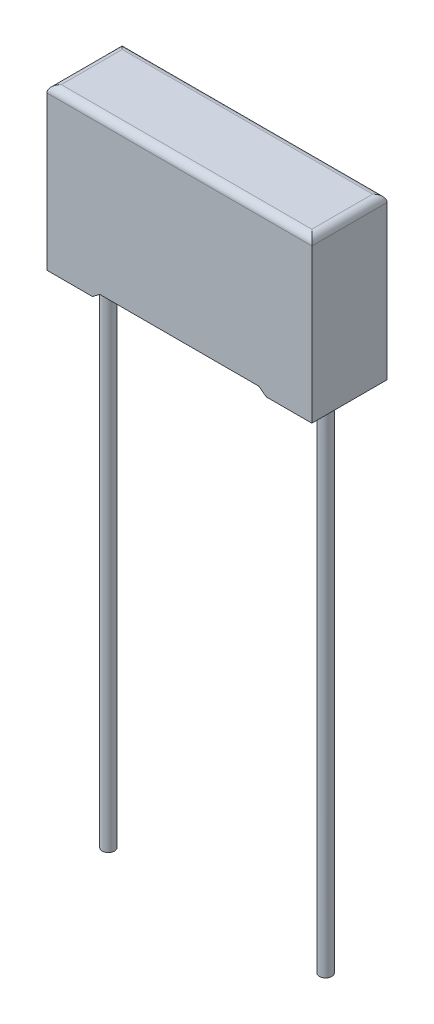
ISO-10303-21;
HEADER;
FILE_DESCRIPTION(('STEP AP214'),'2;1');
FILE_NAME('part.step','',(''),(''),'','','');
FILE_SCHEMA(('AUTOMOTIVE_DESIGN { 1 0 10303 214 1 1 1 1 }'));
ENDSEC;
DATA;
#1=APPLICATION_CONTEXT('core data for automotive mechanical design processes');
#2=APPLICATION_PROTOCOL_DEFINITION('international standard','automotive_design',2000,#1);
#3=PRODUCT_CONTEXT('',#1,'mechanical');
#4=PRODUCT('Part','Part','',(#3));
#5=PRODUCT_RELATED_PRODUCT_CATEGORY('part','',(#4));
#6=PRODUCT_DEFINITION_FORMATION('','',#4);
#7=PRODUCT_DEFINITION_CONTEXT('part definition',#1,'design');
#8=PRODUCT_DEFINITION('design','',#6,#7);
#9=PRODUCT_DEFINITION_SHAPE('','',#8);
#10=(LENGTH_UNIT() NAMED_UNIT(*) SI_UNIT(.MILLI.,.METRE.));
#11=(NAMED_UNIT(*) PLANE_ANGLE_UNIT() SI_UNIT($,.RADIAN.));
#12=(NAMED_UNIT(*) SI_UNIT($,.STERADIAN.) SOLID_ANGLE_UNIT());
#13=UNCERTAINTY_MEASURE_WITH_UNIT(LENGTH_MEASURE(1.E-05),#10,'distance_accuracy_value','');
#14=(GEOMETRIC_REPRESENTATION_CONTEXT(3) GLOBAL_UNCERTAINTY_ASSIGNED_CONTEXT((#13)) GLOBAL_UNIT_ASSIGNED_CONTEXT((#10,
#11,#12)) REPRESENTATION_CONTEXT('',''));
#15=CARTESIAN_POINT('',(0.,0.,0.));
#16=DIRECTION('',(0.,0.,1.));
#17=DIRECTION('',(1.,0.,0.));
#18=AXIS2_PLACEMENT_3D('',#15,#16,#17);
#19=CARTESIAN_POINT('',(16.65,-35.,2.6));
#20=DIRECTION('',(0.,1.,0.));
#21=DIRECTION('',(0.,0.,1.));
#22=AXIS2_PLACEMENT_3D('',#19,#20,#21);
#23=CYLINDRICAL_SURFACE('',#22,0.425);
#24=CARTESIAN_POINT('',(16.65,-35.,2.6));
#25=DIRECTION('',(0.,1.,0.));
#26=DIRECTION('',(0.,0.,-1.));
#27=AXIS2_PLACEMENT_3D('',#24,#25,#26);
#28=CIRCLE('',#27,0.425);
#29=CARTESIAN_POINT('',(16.65,-35.,2.175));
#30=VERTEX_POINT('',#29);
#31=EDGE_CURVE('E11',#30,#30,#28,.T.);
#32=ORIENTED_EDGE('',*,*,#31,.T.);
#33=EDGE_LOOP('',(#32));
#34=FACE_BOUND('',#33,.T.);
#35=CARTESIAN_POINT('',(16.65,0.75,2.6));
#36=DIRECTION('',(0.,-1.,0.));
#37=DIRECTION('',(0.,0.,-1.));
#38=AXIS2_PLACEMENT_3D('',#35,#36,#37);
#39=CIRCLE('',#38,0.425);
#40=CARTESIAN_POINT('',(16.65,0.75,3.025));
#41=VERTEX_POINT('',#40);
#42=EDGE_CURVE('E28',#41,#41,#39,.T.);
#43=ORIENTED_EDGE('',*,*,#42,.T.);
#44=EDGE_LOOP('',(#43));
#45=FACE_BOUND('',#44,.T.);
#46=ADVANCED_FACE('F17',(#34,#45),#23,.T.);
#47=CARTESIAN_POINT('',(1.65,-35.,2.6));
#48=DIRECTION('',(0.,1.,0.));
#49=DIRECTION('',(0.,0.,1.));
#50=AXIS2_PLACEMENT_3D('',#47,#48,#49);
#51=CYLINDRICAL_SURFACE('',#50,0.425);
#52=CARTESIAN_POINT('',(1.65,-35.,2.6));
#53=DIRECTION('',(0.,-1.,0.));
#54=DIRECTION('',(0.,0.,-1.));
#55=AXIS2_PLACEMENT_3D('',#52,#53,#54);
#56=CIRCLE('',#55,0.425);
#57=CARTESIAN_POINT('',(1.65,-35.,3.025));
#58=VERTEX_POINT('',#57);
#59=EDGE_CURVE('E188',#58,#58,#56,.T.);
#60=ORIENTED_EDGE('',*,*,#59,.F.);
#61=EDGE_LOOP('',(#60));
#62=FACE_BOUND('',#61,.T.);
#63=CARTESIAN_POINT('',(1.65,0.75,2.6));
#64=DIRECTION('',(0.,-1.,0.));
#65=DIRECTION('',(0.,0.,-1.));
#66=AXIS2_PLACEMENT_3D('',#63,#64,#65);
#67=CIRCLE('',#66,0.425);
#68=CARTESIAN_POINT('',(1.65,0.75,3.025));
#69=VERTEX_POINT('',#68);
#70=EDGE_CURVE('E254',#69,#69,#67,.T.);
#71=ORIENTED_EDGE('',*,*,#70,.T.);
#72=EDGE_LOOP('',(#71));
#73=FACE_BOUND('',#72,.T.);
#74=ADVANCED_FACE('F548',(#62,#73),#51,.T.);
#75=CARTESIAN_POINT('',(0.,0.,5.2));
#76=DIRECTION('',(0.,1.,0.));
#77=DIRECTION('',(1.,0.,0.));
#78=AXIS2_PLACEMENT_3D('',#75,#76,#77);
#79=PLANE('',#78);
#80=DIRECTION('',(0.,0.,1.));
#81=VECTOR('',#80,1.);
#82=CARTESIAN_POINT('',(15.15,0.,0.));
#83=LINE('',#82,#81);
#84=CARTESIAN_POINT('',(15.15,0.,0.));
#85=VERTEX_POINT('',#84);
#86=CARTESIAN_POINT('',(15.15,0.,0.609999939));
#87=VERTEX_POINT('',#86);
#88=EDGE_CURVE('E276',#85,#87,#83,.T.);
#89=ORIENTED_EDGE('',*,*,#88,.F.);
#90=DIRECTION('',(1.,0.,0.));
#91=VECTOR('',#90,1.);
#92=CARTESIAN_POINT('',(0.,0.,0.));
#93=LINE('',#92,#91);
#94=CARTESIAN_POINT('',(18.3,0.,0.));
#95=VERTEX_POINT('',#94);
#96=EDGE_CURVE('E250',#85,#95,#93,.T.);
#97=ORIENTED_EDGE('',*,*,#96,.T.);
#98=DIRECTION('',(0.,0.,-1.));
#99=VECTOR('',#98,1.);
#100=CARTESIAN_POINT('',(18.3,0.,5.2));
#101=LINE('',#100,#99);
#102=CARTESIAN_POINT('',(18.3,0.,5.2));
#103=VERTEX_POINT('',#102);
#104=EDGE_CURVE('E233',#103,#95,#101,.T.);
#105=ORIENTED_EDGE('',*,*,#104,.F.);
#106=DIRECTION('',(1.,0.,0.));
#107=VECTOR('',#106,1.);
#108=CARTESIAN_POINT('',(0.,0.,5.2));
#109=LINE('',#108,#107);
#110=CARTESIAN_POINT('',(15.15,0.,5.2));
#111=VERTEX_POINT('',#110);
#112=EDGE_CURVE('E198',#111,#103,#109,.T.);
#113=ORIENTED_EDGE('',*,*,#112,.F.);
#114=DIRECTION('',(0.,0.,1.));
#115=VECTOR('',#114,1.);
#116=CARTESIAN_POINT('',(15.15,0.,0.));
#117=LINE('',#116,#115);
#118=CARTESIAN_POINT('',(15.15,0.,4.590000061));
#119=VERTEX_POINT('',#118);
#120=EDGE_CURVE('E194',#119,#111,#117,.T.);
#121=ORIENTED_EDGE('',*,*,#120,.F.);
#122=DIRECTION('',(-1.,0.,0.));
#123=VECTOR('',#122,1.);
#124=CARTESIAN_POINT('',(17.690000061,0.,4.590000061));
#125=LINE('',#124,#123);
#126=CARTESIAN_POINT('',(17.690000061,0.,4.590000061));
#127=VERTEX_POINT('',#126);
#128=EDGE_CURVE('E256',#127,#119,#125,.T.);
#129=ORIENTED_EDGE('',*,*,#128,.F.);
#130=DIRECTION('',(0.,0.,1.));
#131=VECTOR('',#130,1.);
#132=CARTESIAN_POINT('',(17.690000061,0.,0.609999939));
#133=LINE('',#132,#131);
#134=CARTESIAN_POINT('',(17.690000061,0.,0.609999939));
#135=VERTEX_POINT('',#134);
#136=EDGE_CURVE('E244',#135,#127,#133,.T.);
#137=ORIENTED_EDGE('',*,*,#136,.F.);
#138=DIRECTION('',(1.,0.,0.));
#139=VECTOR('',#138,1.);
#140=CARTESIAN_POINT('',(0.609999939,0.,0.609999939));
#141=LINE('',#140,#139);
#142=EDGE_CURVE('E293',#87,#135,#141,.T.);
#143=ORIENTED_EDGE('',*,*,#142,.F.);
#144=EDGE_LOOP('',(#89,#97,#105,#113,#121,#129,#137,#143));
#145=FACE_BOUND('',#144,.T.);
#146=ADVANCED_FACE('F543',(#145),#79,.F.);
#147=CARTESIAN_POINT('',(0.,0.,5.2));
#148=DIRECTION('',(0.,0.,-1.));
#149=DIRECTION('',(0.,-1.,0.));
#150=AXIS2_PLACEMENT_3D('',#147,#148,#149);
#151=PLANE('',#150);
#152=DIRECTION('',(0.,1.,0.));
#153=VECTOR('',#152,1.);
#154=CARTESIAN_POINT('',(18.3,0.,5.2));
#155=LINE('',#154,#153);
#156=CARTESIAN_POINT('',(18.3,10.6,5.2));
#157=VERTEX_POINT('',#156);
#158=EDGE_CURVE('E255',#103,#157,#155,.T.);
#159=ORIENTED_EDGE('',*,*,#158,.T.);
#160=DIRECTION('',(-1.,0.,0.));
#161=VECTOR('',#160,1.);
#162=CARTESIAN_POINT('',(0.,10.6,5.2));
#163=LINE('',#162,#161);
#164=CARTESIAN_POINT('',(0.,10.6,5.2));
#165=VERTEX_POINT('',#164);
#166=EDGE_CURVE('E299',#157,#165,#163,.T.);
#167=ORIENTED_EDGE('',*,*,#166,.T.);
#168=DIRECTION('',(0.,-1.,0.));
#169=VECTOR('',#168,1.);
#170=CARTESIAN_POINT('',(0.,0.,5.2));
#171=LINE('',#170,#169);
#172=CARTESIAN_POINT('',(0.,0.,5.2));
#173=VERTEX_POINT('',#172);
#174=EDGE_CURVE('E303',#165,#173,#171,.T.);
#175=ORIENTED_EDGE('',*,*,#174,.T.);
#176=DIRECTION('',(1.,0.,0.));
#177=VECTOR('',#176,1.);
#178=CARTESIAN_POINT('',(0.,0.,5.2));
#179=LINE('',#178,#177);
#180=CARTESIAN_POINT('',(3.15,0.,5.2));
#181=VERTEX_POINT('',#180);
#182=EDGE_CURVE('E197',#173,#181,#179,.T.);
#183=ORIENTED_EDGE('',*,*,#182,.T.);
#184=DIRECTION('',(-0.798802732587283,-0.601593047176486,0.));
#185=VECTOR('',#184,1.);
#186=CARTESIAN_POINT('',(3.15,0.,5.2));
#187=LINE('',#186,#185);
#188=CARTESIAN_POINT('',(3.658191,0.382728,5.2));
#189=VERTEX_POINT('',#188);
#190=EDGE_CURVE('E181',#189,#181,#187,.T.);
#191=ORIENTED_EDGE('',*,*,#190,.F.);
#192=DIRECTION('',(-1.,0.,0.));
#193=VECTOR('',#192,1.);
#194=CARTESIAN_POINT('',(9.15,0.382728,5.2));
#195=LINE('',#194,#193);
#196=CARTESIAN_POINT('',(14.641809,0.382728,5.2));
#197=VERTEX_POINT('',#196);
#198=EDGE_CURVE('E174',#197,#189,#195,.T.);
#199=ORIENTED_EDGE('',*,*,#198,.F.);
#200=DIRECTION('',(0.798802732587283,-0.601593047176486,0.));
#201=VECTOR('',#200,1.);
#202=CARTESIAN_POINT('',(15.15,0.,5.2));
#203=LINE('',#202,#201);
#204=EDGE_CURVE('E179',#197,#111,#203,.T.);
#205=ORIENTED_EDGE('',*,*,#204,.T.);
#206=ORIENTED_EDGE('',*,*,#112,.T.);
#207=EDGE_LOOP('',(#159,#167,#175,#183,#191,#199,#205,#206));
#208=FACE_BOUND('',#207,.T.);
#209=ADVANCED_FACE('F177',(#208),#151,.F.);
#210=CARTESIAN_POINT('',(0.,0.,0.));
#211=DIRECTION('',(0.,0.,-1.));
#212=DIRECTION('',(0.,-1.,0.));
#213=AXIS2_PLACEMENT_3D('',#210,#211,#212);
#214=PLANE('',#213);
#215=DIRECTION('',(0.,-1.,0.));
#216=VECTOR('',#215,1.);
#217=CARTESIAN_POINT('',(0.,0.,0.));
#218=LINE('',#217,#216);
#219=CARTESIAN_POINT('',(0.,10.6,0.));
#220=VERTEX_POINT('',#219);
#221=CARTESIAN_POINT('',(0.,0.,0.));
#222=VERTEX_POINT('',#221);
#223=EDGE_CURVE('E165',#220,#222,#218,.T.);
#224=ORIENTED_EDGE('',*,*,#223,.F.);
#225=DIRECTION('',(1.,0.,0.));
#226=VECTOR('',#225,1.);
#227=CARTESIAN_POINT('',(18.3,10.6,0.));
#228=LINE('',#227,#226);
#229=CARTESIAN_POINT('',(18.3,10.6,0.));
#230=VERTEX_POINT('',#229);
#231=EDGE_CURVE('E225',#220,#230,#228,.T.);
#232=ORIENTED_EDGE('',*,*,#231,.T.);
#233=DIRECTION('',(0.,1.,0.));
#234=VECTOR('',#233,1.);
#235=CARTESIAN_POINT('',(18.3,0.,0.));
#236=LINE('',#235,#234);
#237=EDGE_CURVE('E286',#95,#230,#236,.T.);
#238=ORIENTED_EDGE('',*,*,#237,.F.);
#239=ORIENTED_EDGE('',*,*,#96,.F.);
#240=DIRECTION('',(0.798802732587283,-0.601593047176486,0.));
#241=VECTOR('',#240,1.);
#242=CARTESIAN_POINT('',(15.15,0.,0.));
#243=LINE('',#242,#241);
#244=CARTESIAN_POINT('',(14.641809,0.382728,0.));
#245=VERTEX_POINT('',#244);
#246=EDGE_CURVE('E294',#245,#85,#243,.T.);
#247=ORIENTED_EDGE('',*,*,#246,.F.);
#248=DIRECTION('',(-1.,0.,0.));
#249=VECTOR('',#248,1.);
#250=CARTESIAN_POINT('',(9.15,0.382728,0.));
#251=LINE('',#250,#249);
#252=CARTESIAN_POINT('',(3.658191,0.382728,0.));
#253=VERTEX_POINT('',#252);
#254=EDGE_CURVE('E228',#245,#253,#251,.T.);
#255=ORIENTED_EDGE('',*,*,#254,.T.);
#256=DIRECTION('',(-0.798802732587283,-0.601593047176486,0.));
#257=VECTOR('',#256,1.);
#258=CARTESIAN_POINT('',(3.15,0.,0.));
#259=LINE('',#258,#257);
#260=CARTESIAN_POINT('',(3.15,0.,0.));
#261=VERTEX_POINT('',#260);
#262=EDGE_CURVE('E237',#253,#261,#259,.T.);
#263=ORIENTED_EDGE('',*,*,#262,.T.);
#264=DIRECTION('',(1.,0.,0.));
#265=VECTOR('',#264,1.);
#266=CARTESIAN_POINT('',(0.,0.,0.));
#267=LINE('',#266,#265);
#268=EDGE_CURVE('E242',#222,#261,#267,.T.);
#269=ORIENTED_EDGE('',*,*,#268,.F.);
#270=EDGE_LOOP('',(#224,#232,#238,#239,#247,#255,#263,#269));
#271=FACE_BOUND('',#270,.T.);
#272=ADVANCED_FACE('F589',(#271),#214,.T.);
#273=CARTESIAN_POINT('',(17.690000061,0.75,4.590000061));
#274=DIRECTION('',(0.,0.,1.));
#275=DIRECTION('',(1.,0.,0.));
#276=AXIS2_PLACEMENT_3D('',#273,#274,#275);
#277=PLANE('',#276);
#278=DIRECTION('',(0.798802732587283,-0.601593047176486,0.));
#279=VECTOR('',#278,1.);
#280=CARTESIAN_POINT('',(16.4103223576265,-0.949171975280309,4.590000061));
#281=LINE('',#280,#279);
#282=CARTESIAN_POINT('',(14.641809,0.382728,4.590000061));
#283=VERTEX_POINT('',#282);
#284=EDGE_CURVE('E222',#283,#119,#281,.T.);
#285=ORIENTED_EDGE('',*,*,#284,.F.);
#286=DIRECTION('',(-1.,0.,0.));
#287=VECTOR('',#286,1.);
#288=CARTESIAN_POINT('',(17.690000061,0.382728,4.590000061));
#289=LINE('',#288,#287);
#290=CARTESIAN_POINT('',(3.658191,0.382728,4.590000061));
#291=VERTEX_POINT('',#290);
#292=EDGE_CURVE('E203',#283,#291,#289,.T.);
#293=ORIENTED_EDGE('',*,*,#292,.T.);
#294=DIRECTION('',(-0.798802732587283,-0.601593047176486,0.));
#295=VECTOR('',#294,1.);
#296=CARTESIAN_POINT('',(12.7881832796786,7.25869330677799,4.590000061));
#297=LINE('',#296,#295);
#298=CARTESIAN_POINT('',(3.15,0.,4.590000061));
#299=VERTEX_POINT('',#298);
#300=EDGE_CURVE('E311',#291,#299,#297,.T.);
#301=ORIENTED_EDGE('',*,*,#300,.T.);
#302=DIRECTION('',(-1.,0.,0.));
#303=VECTOR('',#302,1.);
#304=CARTESIAN_POINT('',(17.690000061,0.,4.590000061));
#305=LINE('',#304,#303);
#306=CARTESIAN_POINT('',(0.609999939,0.,4.590000061));
#307=VERTEX_POINT('',#306);
#308=EDGE_CURVE('E307',#299,#307,#305,.T.);
#309=ORIENTED_EDGE('',*,*,#308,.T.);
#310=DIRECTION('',(0.,-1.,0.));
#311=VECTOR('',#310,1.);
#312=CARTESIAN_POINT('',(0.609999939,0.75,4.590000061));
#313=LINE('',#312,#311);
#314=CARTESIAN_POINT('',(0.609999939,0.75,4.590000061));
#315=VERTEX_POINT('',#314);
#316=EDGE_CURVE('E248',#315,#307,#313,.T.);
#317=ORIENTED_EDGE('',*,*,#316,.F.);
#318=DIRECTION('',(-1.,0.,0.));
#319=VECTOR('',#318,1.);
#320=CARTESIAN_POINT('',(17.690000061,0.75,4.590000061));
#321=LINE('',#320,#319);
#322=CARTESIAN_POINT('',(17.690000061,0.75,4.590000061));
#323=VERTEX_POINT('',#322);
#324=EDGE_CURVE('E330',#323,#315,#321,.T.);
#325=ORIENTED_EDGE('',*,*,#324,.F.);
#326=DIRECTION('',(0.,-1.,0.));
#327=VECTOR('',#326,1.);
#328=CARTESIAN_POINT('',(17.690000061,0.75,4.590000061));
#329=LINE('',#328,#327);
#330=EDGE_CURVE('E260',#323,#127,#329,.T.);
#331=ORIENTED_EDGE('',*,*,#330,.T.);
#332=ORIENTED_EDGE('',*,*,#128,.T.);
#333=EDGE_LOOP('',(#285,#293,#301,#309,#317,#325,#331,#332));
#334=FACE_BOUND('',#333,.T.);
#335=ADVANCED_FACE('F473',(#334),#277,.F.);
#336=CARTESIAN_POINT('',(0.609999939,0.75,0.609999939));
#337=DIRECTION('',(0.,0.,-1.));
#338=DIRECTION('',(-1.,0.,0.));
#339=AXIS2_PLACEMENT_3D('',#336,#337,#338);
#340=PLANE('',#339);
#341=DIRECTION('',(1.,0.,0.));
#342=VECTOR('',#341,1.);
#343=CARTESIAN_POINT('',(0.609999939,0.382728,0.609999939));
#344=LINE('',#343,#342);
#345=CARTESIAN_POINT('',(3.658191,0.382728,0.609999939));
#346=VERTEX_POINT('',#345);
#347=CARTESIAN_POINT('',(14.641809,0.382728,0.609999939));
#348=VERTEX_POINT('',#347);
#349=EDGE_CURVE('E261',#346,#348,#344,.T.);
#350=ORIENTED_EDGE('',*,*,#349,.T.);
#351=DIRECTION('',(-0.798802732587283,0.601593047176486,0.));
#352=VECTOR('',#351,1.);
#353=CARTESIAN_POINT('',(5.51181672032144,7.25869330677799,0.609999939));
#354=LINE('',#353,#352);
#355=EDGE_CURVE('E298',#87,#348,#354,.T.);
#356=ORIENTED_EDGE('',*,*,#355,.F.);
#357=ORIENTED_EDGE('',*,*,#142,.T.);
#358=DIRECTION('',(0.,-1.,0.));
#359=VECTOR('',#358,1.);
#360=CARTESIAN_POINT('',(17.690000061,0.75,0.609999939));
#361=LINE('',#360,#359);
#362=CARTESIAN_POINT('',(17.690000061,0.75,0.609999939));
#363=VERTEX_POINT('',#362);
#364=EDGE_CURVE('E249',#363,#135,#361,.T.);
#365=ORIENTED_EDGE('',*,*,#364,.F.);
#366=DIRECTION('',(1.,0.,0.));
#367=VECTOR('',#366,1.);
#368=CARTESIAN_POINT('',(0.609999939,0.75,0.609999939));
#369=LINE('',#368,#367);
#370=CARTESIAN_POINT('',(0.609999939,0.75,0.609999939));
#371=VERTEX_POINT('',#370);
#372=EDGE_CURVE('E318',#371,#363,#369,.T.);
#373=ORIENTED_EDGE('',*,*,#372,.F.);
#374=DIRECTION('',(0.,-1.,0.));
#375=VECTOR('',#374,1.);
#376=CARTESIAN_POINT('',(0.609999939,0.75,0.609999939));
#377=LINE('',#376,#375);
#378=CARTESIAN_POINT('',(0.609999939,0.,0.609999939));
#379=VERTEX_POINT('',#378);
#380=EDGE_CURVE('E265',#371,#379,#377,.T.);
#381=ORIENTED_EDGE('',*,*,#380,.T.);
#382=DIRECTION('',(1.,0.,0.));
#383=VECTOR('',#382,1.);
#384=CARTESIAN_POINT('',(0.609999939,0.,0.609999939));
#385=LINE('',#384,#383);
#386=CARTESIAN_POINT('',(3.15,0.,0.609999939));
#387=VERTEX_POINT('',#386);
#388=EDGE_CURVE('E215',#379,#387,#385,.T.);
#389=ORIENTED_EDGE('',*,*,#388,.T.);
#390=DIRECTION('',(0.798802732587283,0.601593047176486,0.));
#391=VECTOR('',#390,1.);
#392=CARTESIAN_POINT('',(1.8896776423735,-0.949171975280309,0.609999939));
#393=LINE('',#392,#391);
#394=EDGE_CURVE('E213',#387,#346,#393,.T.);
#395=ORIENTED_EDGE('',*,*,#394,.T.);
#396=EDGE_LOOP('',(#350,#356,#357,#365,#373,#381,#389,#395));
#397=FACE_BOUND('',#396,.T.);
#398=ADVANCED_FACE('F432',(#397),#340,.F.);
#399=CARTESIAN_POINT('',(0.,0.75,0.));
#400=DIRECTION('',(0.,-1.,0.));
#401=DIRECTION('',(0.,0.,-1.));
#402=AXIS2_PLACEMENT_3D('',#399,#400,#401);
#403=PLANE('',#402);
#404=DIRECTION('',(0.,0.,-1.));
#405=VECTOR('',#404,1.);
#406=CARTESIAN_POINT('',(0.609999939,0.75,4.590000061));
#407=LINE('',#406,#405);
#408=EDGE_CURVE('E21',#315,#371,#407,.T.);
#409=ORIENTED_EDGE('',*,*,#408,.T.);
#410=ORIENTED_EDGE('',*,*,#372,.T.);
#411=DIRECTION('',(0.,0.,1.));
#412=VECTOR('',#411,1.);
#413=CARTESIAN_POINT('',(17.690000061,0.75,0.609999939));
#414=LINE('',#413,#412);
#415=EDGE_CURVE('E322',#363,#323,#414,.T.);
#416=ORIENTED_EDGE('',*,*,#415,.T.);
#417=ORIENTED_EDGE('',*,*,#324,.T.);
#418=EDGE_LOOP('',(#409,#410,#416,#417));
#419=FACE_BOUND('',#418,.T.);
#420=ORIENTED_EDGE('',*,*,#42,.F.);
#421=EDGE_LOOP('',(#420));
#422=FACE_BOUND('',#421,.T.);
#423=ORIENTED_EDGE('',*,*,#70,.F.);
#424=EDGE_LOOP('',(#423));
#425=FACE_BOUND('',#424,.T.);
#426=ADVANCED_FACE('F438',(#419,#422,#425),#403,.T.);
#427=CARTESIAN_POINT('',(0.,0.,5.2));
#428=DIRECTION('',(0.,1.,0.));
#429=DIRECTION('',(1.,0.,0.));
#430=AXIS2_PLACEMENT_3D('',#427,#428,#429);
#431=PLANE('',#430);
#432=ORIENTED_EDGE('',*,*,#268,.T.);
#433=DIRECTION('',(0.,0.,1.));
#434=VECTOR('',#433,1.);
#435=CARTESIAN_POINT('',(3.15,0.,0.));
#436=LINE('',#435,#434);
#437=EDGE_CURVE('E238',#261,#387,#436,.T.);
#438=ORIENTED_EDGE('',*,*,#437,.T.);
#439=ORIENTED_EDGE('',*,*,#388,.F.);
#440=DIRECTION('',(0.,0.,-1.));
#441=VECTOR('',#440,1.);
#442=CARTESIAN_POINT('',(0.609999939,0.,4.590000061));
#443=LINE('',#442,#441);
#444=EDGE_CURVE('E333',#307,#379,#443,.T.);
#445=ORIENTED_EDGE('',*,*,#444,.F.);
#446=ORIENTED_EDGE('',*,*,#308,.F.);
#447=DIRECTION('',(0.,0.,1.));
#448=VECTOR('',#447,1.);
#449=CARTESIAN_POINT('',(3.15,0.,0.));
#450=LINE('',#449,#448);
#451=EDGE_CURVE('E243',#299,#181,#450,.T.);
#452=ORIENTED_EDGE('',*,*,#451,.T.);
#453=ORIENTED_EDGE('',*,*,#182,.F.);
#454=DIRECTION('',(0.,0.,-1.));
#455=VECTOR('',#454,1.);
#456=CARTESIAN_POINT('',(0.,0.,5.2));
#457=LINE('',#456,#455);
#458=EDGE_CURVE('E269',#173,#222,#457,.T.);
#459=ORIENTED_EDGE('',*,*,#458,.T.);
#460=EDGE_LOOP('',(#432,#438,#439,#445,#446,#452,#453,#459));
#461=FACE_BOUND('',#460,.T.);
#462=ADVANCED_FACE('F499',(#461),#431,.F.);
#463=CARTESIAN_POINT('',(0.,0.,5.2));
#464=DIRECTION('',(1.,0.,0.));
#465=DIRECTION('',(0.,1.,0.));
#466=AXIS2_PLACEMENT_3D('',#463,#464,#465);
#467=PLANE('',#466);
#468=ORIENTED_EDGE('',*,*,#174,.F.);
#469=DIRECTION('',(0.,0.,-1.));
#470=VECTOR('',#469,1.);
#471=CARTESIAN_POINT('',(0.,10.6,5.2));
#472=LINE('',#471,#470);
#473=EDGE_CURVE('E266',#165,#220,#472,.T.);
#474=ORIENTED_EDGE('',*,*,#473,.T.);
#475=ORIENTED_EDGE('',*,*,#223,.T.);
#476=ORIENTED_EDGE('',*,*,#458,.F.);
#477=EDGE_LOOP('',(#468,#474,#475,#476));
#478=FACE_BOUND('',#477,.T.);
#479=ADVANCED_FACE('F504',(#478),#467,.F.);
#480=CARTESIAN_POINT('',(18.3,0.,5.2));
#481=DIRECTION('',(-1.,0.,0.));
#482=DIRECTION('',(0.,0.,1.));
#483=AXIS2_PLACEMENT_3D('',#480,#481,#482);
#484=PLANE('',#483);
#485=ORIENTED_EDGE('',*,*,#237,.T.);
#486=DIRECTION('',(0.,0.,1.));
#487=VECTOR('',#486,1.);
#488=CARTESIAN_POINT('',(18.3,10.6,5.2));
#489=LINE('',#488,#487);
#490=EDGE_CURVE('E366',#230,#157,#489,.T.);
#491=ORIENTED_EDGE('',*,*,#490,.T.);
#492=ORIENTED_EDGE('',*,*,#158,.F.);
#493=ORIENTED_EDGE('',*,*,#104,.T.);
#494=EDGE_LOOP('',(#485,#491,#492,#493));
#495=FACE_BOUND('',#494,.T.);
#496=ADVANCED_FACE('F575',(#495),#484,.F.);
#497=CARTESIAN_POINT('',(0.,11.1,5.2));
#498=DIRECTION('',(0.,-1.,0.));
#499=DIRECTION('',(0.,0.,-1.));
#500=AXIS2_PLACEMENT_3D('',#497,#498,#499);
#501=PLANE('',#500);
#502=DIRECTION('',(-1.,0.,0.));
#503=VECTOR('',#502,1.);
#504=CARTESIAN_POINT('',(0.,11.1,0.5));
#505=LINE('',#504,#503);
#506=CARTESIAN_POINT('',(17.8,11.1,0.5));
#507=VERTEX_POINT('',#506);
#508=CARTESIAN_POINT('',(0.5,11.1,0.5));
#509=VERTEX_POINT('',#508);
#510=EDGE_CURVE('E229',#507,#509,#505,.T.);
#511=ORIENTED_EDGE('',*,*,#510,.T.);
#512=DIRECTION('',(0.,0.,1.));
#513=VECTOR('',#512,1.);
#514=CARTESIAN_POINT('',(0.5,11.1,5.2));
#515=LINE('',#514,#513);
#516=CARTESIAN_POINT('',(0.5,11.1,4.7));
#517=VERTEX_POINT('',#516);
#518=EDGE_CURVE('E220',#509,#517,#515,.T.);
#519=ORIENTED_EDGE('',*,*,#518,.T.);
#520=DIRECTION('',(1.,0.,0.));
#521=VECTOR('',#520,1.);
#522=CARTESIAN_POINT('',(0.,11.1,4.7));
#523=LINE('',#522,#521);
#524=CARTESIAN_POINT('',(17.8,11.1,4.7));
#525=VERTEX_POINT('',#524);
#526=EDGE_CURVE('E216',#517,#525,#523,.T.);
#527=ORIENTED_EDGE('',*,*,#526,.T.);
#528=DIRECTION('',(0.,0.,-1.));
#529=VECTOR('',#528,1.);
#530=CARTESIAN_POINT('',(17.8,11.1,5.2));
#531=LINE('',#530,#529);
#532=EDGE_CURVE('E221',#525,#507,#531,.T.);
#533=ORIENTED_EDGE('',*,*,#532,.T.);
#534=EDGE_LOOP('',(#511,#519,#527,#533));
#535=FACE_BOUND('',#534,.T.);
#536=ADVANCED_FACE('F569',(#535),#501,.F.);
#537=CARTESIAN_POINT('',(0.609999939,0.75,4.590000061));
#538=DIRECTION('',(-1.,0.,0.));
#539=DIRECTION('',(0.,0.,1.));
#540=AXIS2_PLACEMENT_3D('',#537,#538,#539);
#541=PLANE('',#540);
#542=ORIENTED_EDGE('',*,*,#444,.T.);
#543=ORIENTED_EDGE('',*,*,#380,.F.);
#544=ORIENTED_EDGE('',*,*,#408,.F.);
#545=ORIENTED_EDGE('',*,*,#316,.T.);
#546=EDGE_LOOP('',(#542,#543,#544,#545));
#547=FACE_BOUND('',#546,.T.);
#548=ADVANCED_FACE('F574',(#547),#541,.F.);
#549=CARTESIAN_POINT('',(17.690000061,0.75,0.609999939));
#550=DIRECTION('',(1.,0.,0.));
#551=DIRECTION('',(0.,1.,0.));
#552=AXIS2_PLACEMENT_3D('',#549,#550,#551);
#553=PLANE('',#552);
#554=ORIENTED_EDGE('',*,*,#136,.T.);
#555=ORIENTED_EDGE('',*,*,#330,.F.);
#556=ORIENTED_EDGE('',*,*,#415,.F.);
#557=ORIENTED_EDGE('',*,*,#364,.T.);
#558=EDGE_LOOP('',(#554,#555,#556,#557));
#559=FACE_BOUND('',#558,.T.);
#560=ADVANCED_FACE('F428',(#559),#553,.F.);
#561=CARTESIAN_POINT('',(9.15,0.382728,0.));
#562=DIRECTION('',(0.,1.,0.));
#563=DIRECTION('',(1.,0.,0.));
#564=AXIS2_PLACEMENT_3D('',#561,#562,#563);
#565=PLANE('',#564);
#566=DIRECTION('',(0.,0.,1.));
#567=VECTOR('',#566,1.);
#568=CARTESIAN_POINT('',(3.658191,0.382728,0.));
#569=LINE('',#568,#567);
#570=EDGE_CURVE('E326',#253,#346,#569,.T.);
#571=ORIENTED_EDGE('',*,*,#570,.F.);
#572=ORIENTED_EDGE('',*,*,#254,.F.);
#573=DIRECTION('',(0.,0.,1.));
#574=VECTOR('',#573,1.);
#575=CARTESIAN_POINT('',(14.641809,0.382728,0.));
#576=LINE('',#575,#574);
#577=EDGE_CURVE('E323',#245,#348,#576,.T.);
#578=ORIENTED_EDGE('',*,*,#577,.T.);
#579=ORIENTED_EDGE('',*,*,#349,.F.);
#580=EDGE_LOOP('',(#571,#572,#578,#579));
#581=FACE_BOUND('',#580,.T.);
#582=ADVANCED_FACE('F514',(#581),#565,.F.);
#583=CARTESIAN_POINT('',(3.15,0.,0.));
#584=DIRECTION('',(-0.601593047176486,0.798802732587283,0.));
#585=DIRECTION('',(0.,0.,1.));
#586=AXIS2_PLACEMENT_3D('',#583,#584,#585);
#587=PLANE('',#586);
#588=ORIENTED_EDGE('',*,*,#437,.F.);
#589=ORIENTED_EDGE('',*,*,#262,.F.);
#590=ORIENTED_EDGE('',*,*,#570,.T.);
#591=ORIENTED_EDGE('',*,*,#394,.F.);
#592=EDGE_LOOP('',(#588,#589,#590,#591));
#593=FACE_BOUND('',#592,.T.);
#594=ADVANCED_FACE('F519',(#593),#587,.F.);
#595=CARTESIAN_POINT('',(3.15,0.,0.));
#596=DIRECTION('',(-0.601593047176486,0.798802732587283,0.));
#597=DIRECTION('',(0.,0.,1.));
#598=AXIS2_PLACEMENT_3D('',#595,#596,#597);
#599=PLANE('',#598);
#600=DIRECTION('',(0.,0.,1.));
#601=VECTOR('',#600,1.);
#602=CARTESIAN_POINT('',(3.658191,0.382728,0.));
#603=LINE('',#602,#601);
#604=EDGE_CURVE('E210',#291,#189,#603,.T.);
#605=ORIENTED_EDGE('',*,*,#604,.T.);
#606=ORIENTED_EDGE('',*,*,#190,.T.);
#607=ORIENTED_EDGE('',*,*,#451,.F.);
#608=ORIENTED_EDGE('',*,*,#300,.F.);
#609=EDGE_LOOP('',(#605,#606,#607,#608));
#610=FACE_BOUND('',#609,.T.);
#611=ADVANCED_FACE('F533',(#610),#599,.F.);
#612=CARTESIAN_POINT('',(9.15,0.382728,0.));
#613=DIRECTION('',(0.,1.,0.));
#614=DIRECTION('',(1.,0.,0.));
#615=AXIS2_PLACEMENT_3D('',#612,#613,#614);
#616=PLANE('',#615);
#617=ORIENTED_EDGE('',*,*,#292,.F.);
#618=DIRECTION('',(0.,0.,1.));
#619=VECTOR('',#618,1.);
#620=CARTESIAN_POINT('',(14.641809,0.382728,0.));
#621=LINE('',#620,#619);
#622=EDGE_CURVE('E187',#283,#197,#621,.T.);
#623=ORIENTED_EDGE('',*,*,#622,.T.);
#624=ORIENTED_EDGE('',*,*,#198,.T.);
#625=ORIENTED_EDGE('',*,*,#604,.F.);
#626=EDGE_LOOP('',(#617,#623,#624,#625));
#627=FACE_BOUND('',#626,.T.);
#628=ADVANCED_FACE('F201',(#627),#616,.F.);
#629=CARTESIAN_POINT('',(1.65,-35.,2.6));
#630=DIRECTION('',(0.,-1.,0.));
#631=DIRECTION('',(0.,0.,-1.));
#632=AXIS2_PLACEMENT_3D('',#629,#630,#631);
#633=PLANE('',#632);
#634=ORIENTED_EDGE('',*,*,#59,.T.);
#635=EDGE_LOOP('',(#634));
#636=FACE_BOUND('',#635,.T.);
#637=ADVANCED_FACE('F453',(#636),#633,.T.);
#638=CARTESIAN_POINT('',(15.15,0.,0.));
#639=DIRECTION('',(-0.601593047176486,-0.798802732587283,0.));
#640=DIRECTION('',(-0.798802732587283,0.601593047176486,0.));
#641=AXIS2_PLACEMENT_3D('',#638,#639,#640);
#642=PLANE('',#641);
#643=ORIENTED_EDGE('',*,*,#284,.T.);
#644=ORIENTED_EDGE('',*,*,#120,.T.);
#645=ORIENTED_EDGE('',*,*,#204,.F.);
#646=ORIENTED_EDGE('',*,*,#622,.F.);
#647=EDGE_LOOP('',(#643,#644,#645,#646));
#648=FACE_BOUND('',#647,.T.);
#649=ADVANCED_FACE('F193',(#648),#642,.T.);
#650=CARTESIAN_POINT('',(15.15,0.,0.));
#651=DIRECTION('',(-0.601593047176486,-0.798802732587283,0.));
#652=DIRECTION('',(-0.798802732587283,0.601593047176486,0.));
#653=AXIS2_PLACEMENT_3D('',#650,#651,#652);
#654=PLANE('',#653);
#655=ORIENTED_EDGE('',*,*,#355,.T.);
#656=ORIENTED_EDGE('',*,*,#577,.F.);
#657=ORIENTED_EDGE('',*,*,#246,.T.);
#658=ORIENTED_EDGE('',*,*,#88,.T.);
#659=EDGE_LOOP('',(#655,#656,#657,#658));
#660=FACE_BOUND('',#659,.T.);
#661=ADVANCED_FACE('F658',(#660),#654,.T.);
#662=CARTESIAN_POINT('',(16.65,-35.,2.6));
#663=DIRECTION('',(0.,-1.,0.));
#664=DIRECTION('',(0.,0.,-1.));
#665=AXIS2_PLACEMENT_3D('',#662,#663,#664);
#666=PLANE('',#665);
#667=ORIENTED_EDGE('',*,*,#31,.F.);
#668=EDGE_LOOP('',(#667));
#669=FACE_BOUND('',#668,.T.);
#670=ADVANCED_FACE('F488',(#669),#666,.T.);
#671=CARTESIAN_POINT('',(17.8,10.6,5.2));
#672=DIRECTION('',(0.,0.,-1.));
#673=DIRECTION('',(-1.,0.,0.));
#674=AXIS2_PLACEMENT_3D('',#671,#672,#673);
#675=CYLINDRICAL_SURFACE('',#674,0.5);
#676=CARTESIAN_POINT('',(17.8,11.1,0.5));
#677=CARTESIAN_POINT('',(18.0928932188134,11.1,0.207106781186548));
#678=CARTESIAN_POINT('',(18.3,10.8928932188135,0.));
#679=CARTESIAN_POINT('',(18.3,10.6,0.));
#680=(BOUNDED_CURVE() B_SPLINE_CURVE(3,(#676,#677,#678,#679),.UNSPECIFIED.,.F.,
.F.) B_SPLINE_CURVE_WITH_KNOTS((4,4),(4.71238898038469,6.28318530717959),
.UNSPECIFIED.) CURVE() GEOMETRIC_REPRESENTATION_ITEM() RATIONAL_B_SPLINE_CURVE((1.,
0.804737854124365,0.804737854124365,1.)) REPRESENTATION_ITEM(''));
#681=EDGE_CURVE('E277',#507,#230,#680,.T.);
#682=ORIENTED_EDGE('',*,*,#681,.F.);
#683=ORIENTED_EDGE('',*,*,#532,.F.);
#684=CARTESIAN_POINT('',(18.3,10.6,5.2));
#685=CARTESIAN_POINT('',(18.3,10.8928932188135,5.2));
#686=CARTESIAN_POINT('',(18.0928932188134,11.1,4.99289321881345));
#687=CARTESIAN_POINT('',(17.8,11.1,4.7));
#688=(BOUNDED_CURVE() B_SPLINE_CURVE(3,(#684,#685,#686,#687),.UNSPECIFIED.,.F.,
.F.) B_SPLINE_CURVE_WITH_KNOTS((4,4),(3.1415926535898,4.71238898038469),
.UNSPECIFIED.) CURVE() GEOMETRIC_REPRESENTATION_ITEM() RATIONAL_B_SPLINE_CURVE((1.,
0.804737854124365,0.804737854124365,1.)) REPRESENTATION_ITEM(''));
#689=EDGE_CURVE('E270',#157,#525,#688,.T.);
#690=ORIENTED_EDGE('',*,*,#689,.F.);
#691=ORIENTED_EDGE('',*,*,#490,.F.);
#692=EDGE_LOOP('',(#682,#683,#690,#691));
#693=FACE_BOUND('',#692,.T.);
#694=ADVANCED_FACE('F483',(#693),#675,.T.);
#695=CARTESIAN_POINT('',(0.,10.6,4.7));
#696=DIRECTION('',(-1.,0.,0.));
#697=DIRECTION('',(0.,0.,1.));
#698=AXIS2_PLACEMENT_3D('',#695,#696,#697);
#699=CYLINDRICAL_SURFACE('',#698,0.5);
#700=ORIENTED_EDGE('',*,*,#689,.T.);
#701=ORIENTED_EDGE('',*,*,#526,.F.);
#702=CARTESIAN_POINT('',(0.,10.6,5.2));
#703=CARTESIAN_POINT('',(0.,10.8928932188135,5.2));
#704=CARTESIAN_POINT('',(0.207106781186547,11.1,4.99289321881345));
#705=CARTESIAN_POINT('',(0.5,11.1,4.7));
#706=(BOUNDED_CURVE() B_SPLINE_CURVE(3,(#702,#703,#704,#705),.UNSPECIFIED.,.F.,
.F.) B_SPLINE_CURVE_WITH_KNOTS((4,4),(0.,1.5707963267949),
.UNSPECIFIED.) CURVE() GEOMETRIC_REPRESENTATION_ITEM() RATIONAL_B_SPLINE_CURVE((1.,
0.804737854124365,0.804737854124365,1.)) REPRESENTATION_ITEM(''));
#707=EDGE_CURVE('E349',#165,#517,#706,.T.);
#708=ORIENTED_EDGE('',*,*,#707,.F.);
#709=ORIENTED_EDGE('',*,*,#166,.F.);
#710=EDGE_LOOP('',(#700,#701,#708,#709));
#711=FACE_BOUND('',#710,.T.);
#712=ADVANCED_FACE('F19',(#711),#699,.T.);
#713=CARTESIAN_POINT('',(0.,10.6,0.5));
#714=DIRECTION('',(1.,0.,0.));
#715=DIRECTION('',(0.,0.,-1.));
#716=AXIS2_PLACEMENT_3D('',#713,#714,#715);
#717=CYLINDRICAL_SURFACE('',#716,0.5);
#718=ORIENTED_EDGE('',*,*,#681,.T.);
#719=ORIENTED_EDGE('',*,*,#231,.F.);
#720=CARTESIAN_POINT('',(0.5,11.1,0.5));
#721=CARTESIAN_POINT('',(0.207106781186547,11.1,0.207106781186548));
#722=CARTESIAN_POINT('',(0.,10.8928932188135,0.));
#723=CARTESIAN_POINT('',(0.,10.6,0.));
#724=(BOUNDED_CURVE() B_SPLINE_CURVE(3,(#720,#721,#722,#723),.UNSPECIFIED.,.F.,
.F.) B_SPLINE_CURVE_WITH_KNOTS((4,4),(1.5707963267949,3.1415926535898),
.UNSPECIFIED.) CURVE() GEOMETRIC_REPRESENTATION_ITEM() RATIONAL_B_SPLINE_CURVE((1.,
0.804737854124365,0.804737854124365,1.)) REPRESENTATION_ITEM(''));
#725=EDGE_CURVE('E355',#509,#220,#724,.T.);
#726=ORIENTED_EDGE('',*,*,#725,.F.);
#727=ORIENTED_EDGE('',*,*,#510,.F.);
#728=EDGE_LOOP('',(#718,#719,#726,#727));
#729=FACE_BOUND('',#728,.T.);
#730=ADVANCED_FACE('F621',(#729),#717,.T.);
#731=CARTESIAN_POINT('',(0.5,10.6,5.2));
#732=DIRECTION('',(0.,0.,-1.));
#733=DIRECTION('',(-1.,0.,0.));
#734=AXIS2_PLACEMENT_3D('',#731,#732,#733);
#735=CYLINDRICAL_SURFACE('',#734,0.5);
#736=ORIENTED_EDGE('',*,*,#707,.T.);
#737=ORIENTED_EDGE('',*,*,#518,.F.);
#738=ORIENTED_EDGE('',*,*,#725,.T.);
#739=ORIENTED_EDGE('',*,*,#473,.F.);
#740=EDGE_LOOP('',(#736,#737,#738,#739));
#741=FACE_BOUND('',#740,.T.);
#742=ADVANCED_FACE('F626',(#741),#735,.T.);
#743=CLOSED_SHELL('',(#46,#74,#146,#209,#272,#335,#398,#426,#462,#479,#496,#536,#548,#560,#582,
#594,#611,#628,#637,#649,#661,#670,#694,#712,#730,#742));
#744=MANIFOLD_SOLID_BREP('B1',#743);
#745=ADVANCED_BREP_SHAPE_REPRESENTATION('',(#18,#744),#14);
#746=SHAPE_DEFINITION_REPRESENTATION(#9,#745);
ENDSEC;
END-ISO-10303-21;
